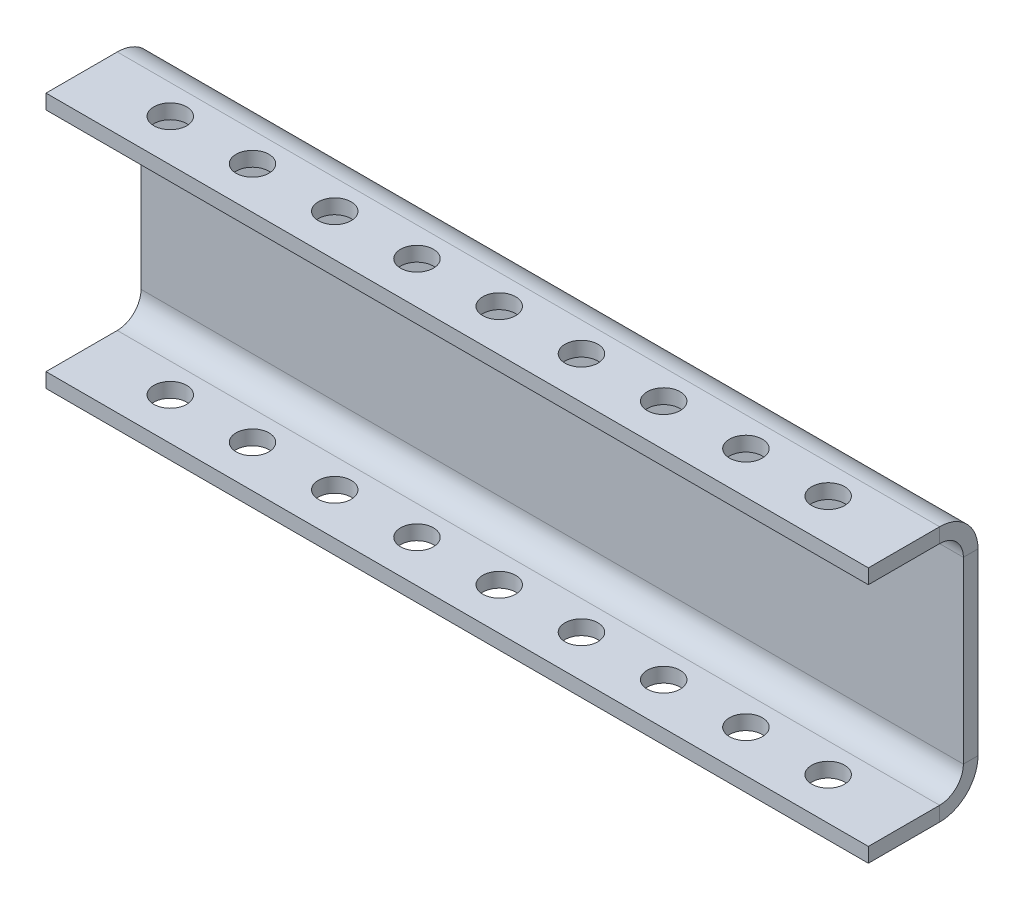
ISO-10303-21;
HEADER;
FILE_DESCRIPTION(('STEP AP214'),'2;1');
FILE_NAME('part.step','',(''),(''),'','','');
FILE_SCHEMA(('AUTOMOTIVE_DESIGN { 1 0 10303 214 1 1 1 1 }'));
ENDSEC;
DATA;
#1=APPLICATION_CONTEXT('core data for automotive mechanical design processes');
#2=APPLICATION_PROTOCOL_DEFINITION('international standard','automotive_design',2000,#1);
#3=PRODUCT_CONTEXT('',#1,'mechanical');
#4=PRODUCT('Part','Part','',(#3));
#5=PRODUCT_RELATED_PRODUCT_CATEGORY('part','',(#4));
#6=PRODUCT_DEFINITION_FORMATION('','',#4);
#7=PRODUCT_DEFINITION_CONTEXT('part definition',#1,'design');
#8=PRODUCT_DEFINITION('design','',#6,#7);
#9=PRODUCT_DEFINITION_SHAPE('','',#8);
#10=(LENGTH_UNIT() NAMED_UNIT(*) SI_UNIT(.MILLI.,.METRE.));
#11=(NAMED_UNIT(*) PLANE_ANGLE_UNIT() SI_UNIT($,.RADIAN.));
#12=(NAMED_UNIT(*) SI_UNIT($,.STERADIAN.) SOLID_ANGLE_UNIT());
#13=UNCERTAINTY_MEASURE_WITH_UNIT(LENGTH_MEASURE(1.E-05),#10,'distance_accuracy_value','');
#14=(GEOMETRIC_REPRESENTATION_CONTEXT(3) GLOBAL_UNCERTAINTY_ASSIGNED_CONTEXT((#13)) GLOBAL_UNIT_ASSIGNED_CONTEXT((#10,
#11,#12)) REPRESENTATION_CONTEXT('',''));
#15=CARTESIAN_POINT('',(0.,0.,0.));
#16=DIRECTION('',(0.,0.,1.));
#17=DIRECTION('',(1.,0.,0.));
#18=AXIS2_PLACEMENT_3D('',#15,#16,#17);
#19=CARTESIAN_POINT('',(0.,229.4,0.));
#20=DIRECTION('',(0.,0.,-1.));
#21=DIRECTION('',(-1.,0.,0.));
#22=AXIS2_PLACEMENT_3D('',#19,#20,#21);
#23=PLANE('',#22);
#24=DIRECTION('',(0.,1.,0.));
#25=VECTOR('',#24,1.);
#26=CARTESIAN_POINT('',(450.,0.,0.));
#27=LINE('',#26,#25);
#28=CARTESIAN_POINT('',(450.,65.7000000000002,0.));
#29=VERTEX_POINT('',#28);
#30=CARTESIAN_POINT('',(450.,163.7,0.));
#31=VERTEX_POINT('',#30);
#32=EDGE_CURVE('E61',#29,#31,#27,.T.);
#33=ORIENTED_EDGE('',*,*,#32,.T.);
#34=DIRECTION('',(-1.,0.,0.));
#35=VECTOR('',#34,1.);
#36=CARTESIAN_POINT('',(0.,163.7,0.));
#37=LINE('',#36,#35);
#38=CARTESIAN_POINT('',(0.,163.7,0.));
#39=VERTEX_POINT('',#38);
#40=EDGE_CURVE('E53',#31,#39,#37,.T.);
#41=ORIENTED_EDGE('',*,*,#40,.T.);
#42=DIRECTION('',(0.,-1.,0.));
#43=VECTOR('',#42,1.);
#44=CARTESIAN_POINT('',(0.,0.,0.));
#45=LINE('',#44,#43);
#46=CARTESIAN_POINT('',(0.,65.7000000000001,0.));
#47=VERTEX_POINT('',#46);
#48=EDGE_CURVE('E69',#39,#47,#45,.T.);
#49=ORIENTED_EDGE('',*,*,#48,.T.);
#50=DIRECTION('',(-1.,0.,0.));
#51=VECTOR('',#50,1.);
#52=CARTESIAN_POINT('',(0.,65.7000000000002,0.));
#53=LINE('',#52,#51);
#54=EDGE_CURVE('E286',#29,#47,#53,.T.);
#55=ORIENTED_EDGE('',*,*,#54,.F.);
#56=EDGE_LOOP('',(#33,#41,#49,#55));
#57=FACE_BOUND('',#56,.T.);
#58=ADVANCED_FACE('F44',(#57),#23,.F.);
#59=CARTESIAN_POINT('',(0.,229.4,-8.));
#60=DIRECTION('',(0.,0.,-1.));
#61=DIRECTION('',(-1.,0.,0.));
#62=AXIS2_PLACEMENT_3D('',#59,#60,#61);
#63=PLANE('',#62);
#64=DIRECTION('',(-1.,0.,0.));
#65=VECTOR('',#64,1.);
#66=CARTESIAN_POINT('',(0.,163.7,-8.));
#67=LINE('',#66,#65);
#68=CARTESIAN_POINT('',(450.,163.7,-8.));
#69=VERTEX_POINT('',#68);
#70=CARTESIAN_POINT('',(0.,163.7,-8.));
#71=VERTEX_POINT('',#70);
#72=EDGE_CURVE('E290',#69,#71,#67,.T.);
#73=ORIENTED_EDGE('',*,*,#72,.F.);
#74=DIRECTION('',(0.,1.,0.));
#75=VECTOR('',#74,1.);
#76=CARTESIAN_POINT('',(450.,0.,-8.));
#77=LINE('',#76,#75);
#78=CARTESIAN_POINT('',(450.,65.7000000000002,-7.99999999999999));
#79=VERTEX_POINT('',#78);
#80=EDGE_CURVE('E283',#79,#69,#77,.T.);
#81=ORIENTED_EDGE('',*,*,#80,.F.);
#82=DIRECTION('',(-1.,0.,0.));
#83=VECTOR('',#82,1.);
#84=CARTESIAN_POINT('',(0.,65.7000000000002,-8.));
#85=LINE('',#84,#83);
#86=CARTESIAN_POINT('',(0.,65.7000000000002,-8.));
#87=VERTEX_POINT('',#86);
#88=EDGE_CURVE('E279',#79,#87,#85,.T.);
#89=ORIENTED_EDGE('',*,*,#88,.T.);
#90=DIRECTION('',(0.,-1.,0.));
#91=VECTOR('',#90,1.);
#92=CARTESIAN_POINT('',(0.,0.,-8.));
#93=LINE('',#92,#91);
#94=EDGE_CURVE('E48',#71,#87,#93,.T.);
#95=ORIENTED_EDGE('',*,*,#94,.F.);
#96=EDGE_LOOP('',(#73,#81,#89,#95));
#97=FACE_BOUND('',#96,.T.);
#98=ADVANCED_FACE('F304',(#97),#63,.T.);
#99=CARTESIAN_POINT('',(450.,0.,-8.));
#100=DIRECTION('',(1.,0.,0.));
#101=DIRECTION('',(0.,0.,-1.));
#102=AXIS2_PLACEMENT_3D('',#99,#100,#101);
#103=PLANE('',#102);
#104=DIRECTION('',(0.,0.,-1.));
#105=VECTOR('',#104,1.);
#106=CARTESIAN_POINT('',(450.,163.7,-7.99999999999886));
#107=LINE('',#106,#105);
#108=EDGE_CURVE('E12',#31,#69,#107,.T.);
#109=ORIENTED_EDGE('',*,*,#108,.F.);
#110=ORIENTED_EDGE('',*,*,#32,.F.);
#111=DIRECTION('',(0.,0.,-1.));
#112=VECTOR('',#111,1.);
#113=CARTESIAN_POINT('',(450.,65.7000000000001,-7.99999999999954));
#114=LINE('',#113,#112);
#115=EDGE_CURVE('E282',#29,#79,#114,.T.);
#116=ORIENTED_EDGE('',*,*,#115,.T.);
#117=ORIENTED_EDGE('',*,*,#80,.T.);
#118=EDGE_LOOP('',(#109,#110,#116,#117));
#119=FACE_BOUND('',#118,.T.);
#120=ADVANCED_FACE('F46',(#119),#103,.T.);
#121=CARTESIAN_POINT('',(0.,0.,-8.));
#122=DIRECTION('',(-1.,0.,0.));
#123=DIRECTION('',(0.,0.,1.));
#124=AXIS2_PLACEMENT_3D('',#121,#122,#123);
#125=PLANE('',#124);
#126=DIRECTION('',(0.,0.,1.));
#127=VECTOR('',#126,1.);
#128=CARTESIAN_POINT('',(0.,163.7,-7.99999999999886));
#129=LINE('',#128,#127);
#130=EDGE_CURVE('E293',#71,#39,#129,.T.);
#131=ORIENTED_EDGE('',*,*,#130,.F.);
#132=ORIENTED_EDGE('',*,*,#94,.T.);
#133=DIRECTION('',(0.,0.,1.));
#134=VECTOR('',#133,1.);
#135=CARTESIAN_POINT('',(0.,65.7000000000002,-7.99999999999954));
#136=LINE('',#135,#134);
#137=EDGE_CURVE('E288',#87,#47,#136,.T.);
#138=ORIENTED_EDGE('',*,*,#137,.T.);
#139=ORIENTED_EDGE('',*,*,#48,.F.);
#140=EDGE_LOOP('',(#131,#132,#138,#139));
#141=FACE_BOUND('',#140,.T.);
#142=ADVANCED_FACE('F299',(#141),#125,.T.);
#143=CARTESIAN_POINT('',(450.,65.7000000000001,13.));
#144=DIRECTION('',(1.,0.,0.));
#145=DIRECTION('',(0.,0.,-1.));
#146=AXIS2_PLACEMENT_3D('',#143,#144,#145);
#147=PLANE('',#146);
#148=ORIENTED_EDGE('',*,*,#115,.F.);
#149=CARTESIAN_POINT('',(450.,65.7000000000002,13.));
#150=DIRECTION('',(-1.,0.,0.));
#151=DIRECTION('',(0.,-1.,0.));
#152=AXIS2_PLACEMENT_3D('',#149,#150,#151);
#153=CIRCLE('',#152,13.);
#154=CARTESIAN_POINT('',(450.,52.7000000000001,13.0000000000001));
#155=VERTEX_POINT('',#154);
#156=EDGE_CURVE('E185',#29,#155,#153,.T.);
#157=ORIENTED_EDGE('',*,*,#156,.T.);
#158=DIRECTION('',(0.,-1.,0.));
#159=VECTOR('',#158,1.);
#160=CARTESIAN_POINT('',(450.,44.7000000000004,13.0000000000001));
#161=LINE('',#160,#159);
#162=CARTESIAN_POINT('',(450.,44.7000000000001,13.));
#163=VERTEX_POINT('',#162);
#164=EDGE_CURVE('E260',#155,#163,#161,.T.);
#165=ORIENTED_EDGE('',*,*,#164,.T.);
#166=CARTESIAN_POINT('',(450.,65.7000000000001,13.));
#167=DIRECTION('',(-1.,0.,0.));
#168=DIRECTION('',(0.,0.,-1.));
#169=AXIS2_PLACEMENT_3D('',#166,#167,#168);
#170=CIRCLE('',#169,21.);
#171=EDGE_CURVE('E268',#79,#163,#170,.T.);
#172=ORIENTED_EDGE('',*,*,#171,.F.);
#173=EDGE_LOOP('',(#148,#157,#165,#172));
#174=FACE_BOUND('',#173,.T.);
#175=ADVANCED_FACE('F439',(#174),#147,.T.);
#176=CARTESIAN_POINT('',(0.,65.7000000000002,13.));
#177=DIRECTION('',(-1.,0.,0.));
#178=DIRECTION('',(0.,-1.,0.));
#179=AXIS2_PLACEMENT_3D('',#176,#177,#178);
#180=PLANE('',#179);
#181=DIRECTION('',(0.,1.,0.));
#182=VECTOR('',#181,1.);
#183=CARTESIAN_POINT('',(0.,44.7000000000005,13.0000000000001));
#184=LINE('',#183,#182);
#185=CARTESIAN_POINT('',(0.,44.7000000000002,13.0000000000001));
#186=VERTEX_POINT('',#185);
#187=CARTESIAN_POINT('',(0.,52.7000000000002,13.0000000000001));
#188=VERTEX_POINT('',#187);
#189=EDGE_CURVE('E263',#186,#188,#184,.T.);
#190=ORIENTED_EDGE('',*,*,#189,.T.);
#191=CARTESIAN_POINT('',(0.,65.7000000000002,13.));
#192=DIRECTION('',(-1.,0.,0.));
#193=DIRECTION('',(0.,-1.,0.));
#194=AXIS2_PLACEMENT_3D('',#191,#192,#193);
#195=CIRCLE('',#194,13.);
#196=EDGE_CURVE('E272',#188,#47,#195,.F.);
#197=ORIENTED_EDGE('',*,*,#196,.T.);
#198=ORIENTED_EDGE('',*,*,#137,.F.);
#199=CARTESIAN_POINT('',(0.,65.7000000000002,13.));
#200=DIRECTION('',(1.,0.,0.));
#201=DIRECTION('',(0.,-1.,0.));
#202=AXIS2_PLACEMENT_3D('',#199,#200,#201);
#203=CIRCLE('',#202,21.);
#204=EDGE_CURVE('E271',#186,#87,#203,.T.);
#205=ORIENTED_EDGE('',*,*,#204,.F.);
#206=EDGE_LOOP('',(#190,#197,#198,#205));
#207=FACE_BOUND('',#206,.T.);
#208=ADVANCED_FACE('F309',(#207),#180,.T.);
#209=CARTESIAN_POINT('',(675.862594276769,65.7000000000001,13.));
#210=DIRECTION('',(-1.,0.,0.));
#211=DIRECTION('',(0.,-1.,0.));
#212=AXIS2_PLACEMENT_3D('',#209,#210,#211);
#213=CYLINDRICAL_SURFACE('',#212,21.);
#214=ORIENTED_EDGE('',*,*,#204,.T.);
#215=ORIENTED_EDGE('',*,*,#88,.F.);
#216=ORIENTED_EDGE('',*,*,#171,.T.);
#217=DIRECTION('',(-1.,0.,0.));
#218=VECTOR('',#217,1.);
#219=CARTESIAN_POINT('',(0.,44.7000000000002,13.));
#220=LINE('',#219,#218);
#221=EDGE_CURVE('E177',#163,#186,#220,.T.);
#222=ORIENTED_EDGE('',*,*,#221,.T.);
#223=EDGE_LOOP('',(#214,#215,#216,#222));
#224=FACE_BOUND('',#223,.T.);
#225=ADVANCED_FACE('F306',(#224),#213,.T.);
#226=CARTESIAN_POINT('',(675.862594276769,65.7000000000001,13.));
#227=DIRECTION('',(-1.,0.,0.));
#228=DIRECTION('',(0.,-1.,0.));
#229=AXIS2_PLACEMENT_3D('',#226,#227,#228);
#230=CYLINDRICAL_SURFACE('',#229,13.);
#231=ORIENTED_EDGE('',*,*,#196,.F.);
#232=DIRECTION('',(-1.,0.,0.));
#233=VECTOR('',#232,1.);
#234=CARTESIAN_POINT('',(0.,52.7000000000002,13.0000000000001));
#235=LINE('',#234,#233);
#236=EDGE_CURVE('E193',#155,#188,#235,.T.);
#237=ORIENTED_EDGE('',*,*,#236,.F.);
#238=ORIENTED_EDGE('',*,*,#156,.F.);
#239=ORIENTED_EDGE('',*,*,#54,.T.);
#240=EDGE_LOOP('',(#231,#237,#238,#239));
#241=FACE_BOUND('',#240,.T.);
#242=ADVANCED_FACE('F446',(#241),#230,.F.);
#243=CARTESIAN_POINT('',(89.9999999999999,44.7000000000003,28.996462444487));
#244=DIRECTION('',(0.,1.,0.));
#245=DIRECTION('',(1.,0.,0.));
#246=AXIS2_PLACEMENT_3D('',#243,#244,#245);
#247=CYLINDRICAL_SURFACE('',#246,9.00000000000001);
#248=CARTESIAN_POINT('',(89.9999999999999,44.7000000000003,28.996462444487));
#249=DIRECTION('',(0.,1.,0.));
#250=DIRECTION('',(-1.,0.,0.));
#251=AXIS2_PLACEMENT_3D('',#248,#249,#250);
#252=CIRCLE('',#251,9.00000000000001);
#253=CARTESIAN_POINT('',(80.9999999999999,44.7000000000003,28.996462444487));
#254=VERTEX_POINT('',#253);
#255=EDGE_CURVE('E201',#254,#254,#252,.T.);
#256=ORIENTED_EDGE('',*,*,#255,.F.);
#257=EDGE_LOOP('',(#256));
#258=FACE_BOUND('',#257,.T.);
#259=CARTESIAN_POINT('',(89.9999999999999,52.7000000000002,28.9964624444869));
#260=DIRECTION('',(0.,1.,0.));
#261=DIRECTION('',(-1.,0.,0.));
#262=AXIS2_PLACEMENT_3D('',#259,#260,#261);
#263=CIRCLE('',#262,9.00000000000001);
#264=CARTESIAN_POINT('',(80.9999999999999,52.7000000000002,28.9964624444869));
#265=VERTEX_POINT('',#264);
#266=EDGE_CURVE('E257',#265,#265,#263,.T.);
#267=ORIENTED_EDGE('',*,*,#266,.T.);
#268=EDGE_LOOP('',(#267));
#269=FACE_BOUND('',#268,.T.);
#270=ADVANCED_FACE('F449',(#258,#269),#247,.F.);
#271=CARTESIAN_POINT('',(135.,44.7000000000002,28.9964624444869));
#272=DIRECTION('',(0.,1.,0.));
#273=DIRECTION('',(1.,0.,0.));
#274=AXIS2_PLACEMENT_3D('',#271,#272,#273);
#275=CYLINDRICAL_SURFACE('',#274,9.00000000000004);
#276=CARTESIAN_POINT('',(135.,44.7000000000002,28.9964624444869));
#277=DIRECTION('',(0.,1.,0.));
#278=DIRECTION('',(-1.,0.,0.));
#279=AXIS2_PLACEMENT_3D('',#276,#277,#278);
#280=CIRCLE('',#279,9.00000000000004);
#281=CARTESIAN_POINT('',(126.,44.7000000000002,28.9964624444869));
#282=VERTEX_POINT('',#281);
#283=EDGE_CURVE('E204',#282,#282,#280,.T.);
#284=ORIENTED_EDGE('',*,*,#283,.F.);
#285=EDGE_LOOP('',(#284));
#286=FACE_BOUND('',#285,.T.);
#287=CARTESIAN_POINT('',(135.,52.7000000000002,28.9964624444869));
#288=DIRECTION('',(0.,1.,0.));
#289=DIRECTION('',(-1.,0.,0.));
#290=AXIS2_PLACEMENT_3D('',#287,#288,#289);
#291=CIRCLE('',#290,9.00000000000004);
#292=CARTESIAN_POINT('',(126.,52.7000000000002,28.9964624444869));
#293=VERTEX_POINT('',#292);
#294=EDGE_CURVE('E254',#293,#293,#291,.T.);
#295=ORIENTED_EDGE('',*,*,#294,.T.);
#296=EDGE_LOOP('',(#295));
#297=FACE_BOUND('',#296,.T.);
#298=ADVANCED_FACE('F499',(#286,#297),#275,.F.);
#299=CARTESIAN_POINT('',(45.,44.7000000000003,28.996462444487));
#300=DIRECTION('',(0.,1.,0.));
#301=DIRECTION('',(1.,0.,0.));
#302=AXIS2_PLACEMENT_3D('',#299,#300,#301);
#303=CYLINDRICAL_SURFACE('',#302,9.00000000000001);
#304=CARTESIAN_POINT('',(45.,44.7000000000003,28.996462444487));
#305=DIRECTION('',(0.,1.,0.));
#306=DIRECTION('',(-1.,0.,0.));
#307=AXIS2_PLACEMENT_3D('',#304,#305,#306);
#308=CIRCLE('',#307,9.00000000000001);
#309=CARTESIAN_POINT('',(36.,44.7000000000003,28.996462444487));
#310=VERTEX_POINT('',#309);
#311=EDGE_CURVE('E207',#310,#310,#308,.T.);
#312=ORIENTED_EDGE('',*,*,#311,.F.);
#313=EDGE_LOOP('',(#312));
#314=FACE_BOUND('',#313,.T.);
#315=CARTESIAN_POINT('',(45.,52.7000000000003,28.9964624444869));
#316=DIRECTION('',(0.,1.,0.));
#317=DIRECTION('',(-1.,0.,0.));
#318=AXIS2_PLACEMENT_3D('',#315,#316,#317);
#319=CIRCLE('',#318,9.00000000000001);
#320=CARTESIAN_POINT('',(36.,52.7000000000003,28.9964624444869));
#321=VERTEX_POINT('',#320);
#322=EDGE_CURVE('E251',#321,#321,#319,.T.);
#323=ORIENTED_EDGE('',*,*,#322,.T.);
#324=EDGE_LOOP('',(#323));
#325=FACE_BOUND('',#324,.T.);
#326=ADVANCED_FACE('F495',(#314,#325),#303,.F.);
#327=CARTESIAN_POINT('',(180.,44.7000000000002,28.9964624444869));
#328=DIRECTION('',(0.,1.,0.));
#329=DIRECTION('',(1.,0.,0.));
#330=AXIS2_PLACEMENT_3D('',#327,#328,#329);
#331=CYLINDRICAL_SURFACE('',#330,9.00000000000001);
#332=CARTESIAN_POINT('',(180.,44.7000000000002,28.9964624444869));
#333=DIRECTION('',(0.,1.,0.));
#334=DIRECTION('',(-1.,0.,0.));
#335=AXIS2_PLACEMENT_3D('',#332,#333,#334);
#336=CIRCLE('',#335,9.00000000000001);
#337=CARTESIAN_POINT('',(171.,44.7000000000002,28.9964624444869));
#338=VERTEX_POINT('',#337);
#339=EDGE_CURVE('E210',#338,#338,#336,.T.);
#340=ORIENTED_EDGE('',*,*,#339,.F.);
#341=EDGE_LOOP('',(#340));
#342=FACE_BOUND('',#341,.T.);
#343=CARTESIAN_POINT('',(180.,52.7000000000002,28.9964624444869));
#344=DIRECTION('',(0.,1.,0.));
#345=DIRECTION('',(-1.,0.,0.));
#346=AXIS2_PLACEMENT_3D('',#343,#344,#345);
#347=CIRCLE('',#346,9.00000000000001);
#348=CARTESIAN_POINT('',(171.,52.7000000000002,28.9964624444869));
#349=VERTEX_POINT('',#348);
#350=EDGE_CURVE('E248',#349,#349,#347,.T.);
#351=ORIENTED_EDGE('',*,*,#350,.T.);
#352=EDGE_LOOP('',(#351));
#353=FACE_BOUND('',#352,.T.);
#354=ADVANCED_FACE('F491',(#342,#353),#331,.F.);
#355=CARTESIAN_POINT('',(225.,44.7000000000002,28.9964624444869));
#356=DIRECTION('',(0.,1.,0.));
#357=DIRECTION('',(1.,0.,0.));
#358=AXIS2_PLACEMENT_3D('',#355,#356,#357);
#359=CYLINDRICAL_SURFACE('',#358,9.00000000000001);
#360=CARTESIAN_POINT('',(225.,44.7000000000002,28.9964624444869));
#361=DIRECTION('',(0.,1.,0.));
#362=DIRECTION('',(-1.,0.,0.));
#363=AXIS2_PLACEMENT_3D('',#360,#361,#362);
#364=CIRCLE('',#363,9.00000000000001);
#365=CARTESIAN_POINT('',(216.,44.7000000000002,28.9964624444869));
#366=VERTEX_POINT('',#365);
#367=EDGE_CURVE('E213',#366,#366,#364,.T.);
#368=ORIENTED_EDGE('',*,*,#367,.F.);
#369=EDGE_LOOP('',(#368));
#370=FACE_BOUND('',#369,.T.);
#371=CARTESIAN_POINT('',(225.,52.7000000000002,28.9964624444869));
#372=DIRECTION('',(0.,1.,0.));
#373=DIRECTION('',(-1.,0.,0.));
#374=AXIS2_PLACEMENT_3D('',#371,#372,#373);
#375=CIRCLE('',#374,9.00000000000001);
#376=CARTESIAN_POINT('',(216.,52.7000000000002,28.9964624444869));
#377=VERTEX_POINT('',#376);
#378=EDGE_CURVE('E245',#377,#377,#375,.T.);
#379=ORIENTED_EDGE('',*,*,#378,.T.);
#380=EDGE_LOOP('',(#379));
#381=FACE_BOUND('',#380,.T.);
#382=ADVANCED_FACE('F487',(#370,#381),#359,.F.);
#383=CARTESIAN_POINT('',(270.,44.7000000000002,28.9964624444869));
#384=DIRECTION('',(0.,1.,0.));
#385=DIRECTION('',(1.,0.,0.));
#386=AXIS2_PLACEMENT_3D('',#383,#384,#385);
#387=CYLINDRICAL_SURFACE('',#386,8.99999999999998);
#388=CARTESIAN_POINT('',(270.,44.7000000000002,28.9964624444869));
#389=DIRECTION('',(0.,1.,0.));
#390=DIRECTION('',(-1.,0.,0.));
#391=AXIS2_PLACEMENT_3D('',#388,#389,#390);
#392=CIRCLE('',#391,8.99999999999998);
#393=CARTESIAN_POINT('',(261.,44.7000000000002,28.9964624444869));
#394=VERTEX_POINT('',#393);
#395=EDGE_CURVE('E216',#394,#394,#392,.T.);
#396=ORIENTED_EDGE('',*,*,#395,.F.);
#397=EDGE_LOOP('',(#396));
#398=FACE_BOUND('',#397,.T.);
#399=CARTESIAN_POINT('',(270.,52.7000000000002,28.9964624444869));
#400=DIRECTION('',(0.,1.,0.));
#401=DIRECTION('',(-1.,0.,0.));
#402=AXIS2_PLACEMENT_3D('',#399,#400,#401);
#403=CIRCLE('',#402,8.99999999999998);
#404=CARTESIAN_POINT('',(261.,52.7000000000002,28.9964624444869));
#405=VERTEX_POINT('',#404);
#406=EDGE_CURVE('E242',#405,#405,#403,.T.);
#407=ORIENTED_EDGE('',*,*,#406,.T.);
#408=EDGE_LOOP('',(#407));
#409=FACE_BOUND('',#408,.T.);
#410=ADVANCED_FACE('F483',(#398,#409),#387,.F.);
#411=CARTESIAN_POINT('',(315.,44.7000000000002,28.9964624444869));
#412=DIRECTION('',(0.,1.,0.));
#413=DIRECTION('',(1.,0.,0.));
#414=AXIS2_PLACEMENT_3D('',#411,#412,#413);
#415=CYLINDRICAL_SURFACE('',#414,9.00000000000004);
#416=CARTESIAN_POINT('',(315.,44.7000000000002,28.9964624444869));
#417=DIRECTION('',(0.,1.,0.));
#418=DIRECTION('',(-1.,0.,0.));
#419=AXIS2_PLACEMENT_3D('',#416,#417,#418);
#420=CIRCLE('',#419,9.00000000000004);
#421=CARTESIAN_POINT('',(306.,44.7000000000002,28.9964624444869));
#422=VERTEX_POINT('',#421);
#423=EDGE_CURVE('E219',#422,#422,#420,.T.);
#424=ORIENTED_EDGE('',*,*,#423,.F.);
#425=EDGE_LOOP('',(#424));
#426=FACE_BOUND('',#425,.T.);
#427=CARTESIAN_POINT('',(315.,52.7000000000002,28.9964624444869));
#428=DIRECTION('',(0.,1.,0.));
#429=DIRECTION('',(-1.,0.,0.));
#430=AXIS2_PLACEMENT_3D('',#427,#428,#429);
#431=CIRCLE('',#430,9.00000000000004);
#432=CARTESIAN_POINT('',(306.,52.7000000000002,28.9964624444869));
#433=VERTEX_POINT('',#432);
#434=EDGE_CURVE('E239',#433,#433,#431,.T.);
#435=ORIENTED_EDGE('',*,*,#434,.T.);
#436=EDGE_LOOP('',(#435));
#437=FACE_BOUND('',#436,.T.);
#438=ADVANCED_FACE('F479',(#426,#437),#415,.F.);
#439=CARTESIAN_POINT('',(360.,44.7000000000002,28.9964624444869));
#440=DIRECTION('',(0.,1.,0.));
#441=DIRECTION('',(1.,0.,0.));
#442=AXIS2_PLACEMENT_3D('',#439,#440,#441);
#443=CYLINDRICAL_SURFACE('',#442,9.00000000000004);
#444=CARTESIAN_POINT('',(360.,44.7000000000002,28.9964624444869));
#445=DIRECTION('',(0.,1.,0.));
#446=DIRECTION('',(-1.,0.,0.));
#447=AXIS2_PLACEMENT_3D('',#444,#445,#446);
#448=CIRCLE('',#447,9.00000000000004);
#449=CARTESIAN_POINT('',(350.999999999999,44.7000000000002,28.9964624444869));
#450=VERTEX_POINT('',#449);
#451=EDGE_CURVE('E222',#450,#450,#448,.T.);
#452=ORIENTED_EDGE('',*,*,#451,.F.);
#453=EDGE_LOOP('',(#452));
#454=FACE_BOUND('',#453,.T.);
#455=CARTESIAN_POINT('',(360.,52.7000000000002,28.9964624444869));
#456=DIRECTION('',(0.,1.,0.));
#457=DIRECTION('',(-1.,0.,0.));
#458=AXIS2_PLACEMENT_3D('',#455,#456,#457);
#459=CIRCLE('',#458,9.00000000000004);
#460=CARTESIAN_POINT('',(350.999999999999,52.7000000000002,28.9964624444869));
#461=VERTEX_POINT('',#460);
#462=EDGE_CURVE('E236',#461,#461,#459,.T.);
#463=ORIENTED_EDGE('',*,*,#462,.T.);
#464=EDGE_LOOP('',(#463));
#465=FACE_BOUND('',#464,.T.);
#466=ADVANCED_FACE('F475',(#454,#465),#443,.F.);
#467=CARTESIAN_POINT('',(404.999999999999,44.7000000000002,28.9964624444869));
#468=DIRECTION('',(0.,1.,0.));
#469=DIRECTION('',(1.,0.,0.));
#470=AXIS2_PLACEMENT_3D('',#467,#468,#469);
#471=CYLINDRICAL_SURFACE('',#470,9.00000000000004);
#472=CARTESIAN_POINT('',(404.999999999999,44.7000000000002,28.9964624444869));
#473=DIRECTION('',(0.,1.,0.));
#474=DIRECTION('',(-1.,0.,0.));
#475=AXIS2_PLACEMENT_3D('',#472,#473,#474);
#476=CIRCLE('',#475,9.00000000000004);
#477=CARTESIAN_POINT('',(395.999999999999,44.7000000000002,28.9964624444869));
#478=VERTEX_POINT('',#477);
#479=EDGE_CURVE('E225',#478,#478,#476,.T.);
#480=ORIENTED_EDGE('',*,*,#479,.F.);
#481=EDGE_LOOP('',(#480));
#482=FACE_BOUND('',#481,.T.);
#483=CARTESIAN_POINT('',(404.999999999999,52.7000000000002,28.9964624444869));
#484=DIRECTION('',(0.,1.,0.));
#485=DIRECTION('',(-1.,0.,0.));
#486=AXIS2_PLACEMENT_3D('',#483,#484,#485);
#487=CIRCLE('',#486,9.00000000000004);
#488=CARTESIAN_POINT('',(395.999999999999,52.7000000000002,28.9964624444869));
#489=VERTEX_POINT('',#488);
#490=EDGE_CURVE('E233',#489,#489,#487,.T.);
#491=ORIENTED_EDGE('',*,*,#490,.T.);
#492=EDGE_LOOP('',(#491));
#493=FACE_BOUND('',#492,.T.);
#494=ADVANCED_FACE('F471',(#482,#493),#471,.F.);
#495=CARTESIAN_POINT('',(0.,44.7000000000003,51.996462444487));
#496=DIRECTION('',(0.,0.,1.));
#497=DIRECTION('',(0.,-1.,0.));
#498=AXIS2_PLACEMENT_3D('',#495,#496,#497);
#499=PLANE('',#498);
#500=DIRECTION('',(1.,0.,0.));
#501=VECTOR('',#500,1.);
#502=CARTESIAN_POINT('',(0.,52.7000000000003,51.9964624444869));
#503=LINE('',#502,#501);
#504=CARTESIAN_POINT('',(0.,52.7000000000003,51.9964624444869));
#505=VERTEX_POINT('',#504);
#506=CARTESIAN_POINT('',(450.,52.7000000000003,51.9964624444869));
#507=VERTEX_POINT('',#506);
#508=EDGE_CURVE('E188',#505,#507,#503,.T.);
#509=ORIENTED_EDGE('',*,*,#508,.F.);
#510=DIRECTION('',(0.,1.,0.));
#511=VECTOR('',#510,1.);
#512=CARTESIAN_POINT('',(0.,44.7000000000003,51.996462444487));
#513=LINE('',#512,#511);
#514=CARTESIAN_POINT('',(0.,44.7000000000003,51.996462444487));
#515=VERTEX_POINT('',#514);
#516=EDGE_CURVE('E182',#515,#505,#513,.T.);
#517=ORIENTED_EDGE('',*,*,#516,.F.);
#518=DIRECTION('',(1.,0.,0.));
#519=VECTOR('',#518,1.);
#520=CARTESIAN_POINT('',(0.,44.7000000000003,51.996462444487));
#521=LINE('',#520,#519);
#522=CARTESIAN_POINT('',(450.,44.7000000000003,51.9964624444869));
#523=VERTEX_POINT('',#522);
#524=EDGE_CURVE('E230',#515,#523,#521,.T.);
#525=ORIENTED_EDGE('',*,*,#524,.T.);
#526=DIRECTION('',(0.,1.,0.));
#527=VECTOR('',#526,1.);
#528=CARTESIAN_POINT('',(450.,44.7000000000003,51.9964624444869));
#529=LINE('',#528,#527);
#530=EDGE_CURVE('E228',#523,#507,#529,.T.);
#531=ORIENTED_EDGE('',*,*,#530,.T.);
#532=EDGE_LOOP('',(#509,#517,#525,#531));
#533=FACE_BOUND('',#532,.T.);
#534=ADVANCED_FACE('F467',(#533),#499,.T.);
#535=CARTESIAN_POINT('',(0.,44.6999999999995,-177.403537555513));
#536=DIRECTION('',(0.,-1.,0.));
#537=DIRECTION('',(-1.,0.,0.));
#538=AXIS2_PLACEMENT_3D('',#535,#536,#537);
#539=PLANE('',#538);
#540=ORIENTED_EDGE('',*,*,#221,.F.);
#541=DIRECTION('',(0.,0.,-1.));
#542=VECTOR('',#541,1.);
#543=CARTESIAN_POINT('',(450.,44.7000000000003,51.9964624444869));
#544=LINE('',#543,#542);
#545=EDGE_CURVE('E198',#523,#163,#544,.T.);
#546=ORIENTED_EDGE('',*,*,#545,.F.);
#547=ORIENTED_EDGE('',*,*,#524,.F.);
#548=DIRECTION('',(0.,0.,1.));
#549=VECTOR('',#548,1.);
#550=CARTESIAN_POINT('',(0.,44.7000000000003,51.996462444487));
#551=LINE('',#550,#549);
#552=EDGE_CURVE('E186',#186,#515,#551,.T.);
#553=ORIENTED_EDGE('',*,*,#552,.F.);
#554=EDGE_LOOP('',(#540,#546,#547,#553));
#555=FACE_BOUND('',#554,.T.);
#556=ORIENTED_EDGE('',*,*,#479,.T.);
#557=EDGE_LOOP('',(#556));
#558=FACE_BOUND('',#557,.T.);
#559=ORIENTED_EDGE('',*,*,#451,.T.);
#560=EDGE_LOOP('',(#559));
#561=FACE_BOUND('',#560,.T.);
#562=ORIENTED_EDGE('',*,*,#423,.T.);
#563=EDGE_LOOP('',(#562));
#564=FACE_BOUND('',#563,.T.);
#565=ORIENTED_EDGE('',*,*,#395,.T.);
#566=EDGE_LOOP('',(#565));
#567=FACE_BOUND('',#566,.T.);
#568=ORIENTED_EDGE('',*,*,#367,.T.);
#569=EDGE_LOOP('',(#568));
#570=FACE_BOUND('',#569,.T.);
#571=ORIENTED_EDGE('',*,*,#339,.T.);
#572=EDGE_LOOP('',(#571));
#573=FACE_BOUND('',#572,.T.);
#574=ORIENTED_EDGE('',*,*,#311,.T.);
#575=EDGE_LOOP('',(#574));
#576=FACE_BOUND('',#575,.T.);
#577=ORIENTED_EDGE('',*,*,#283,.T.);
#578=EDGE_LOOP('',(#577));
#579=FACE_BOUND('',#578,.T.);
#580=ORIENTED_EDGE('',*,*,#255,.T.);
#581=EDGE_LOOP('',(#580));
#582=FACE_BOUND('',#581,.T.);
#583=ADVANCED_FACE('F463',(#555,#558,#561,#564,#567,#570,#573,#576,#579,#582),#539,.T.);
#584=CARTESIAN_POINT('',(450.,44.7000000000003,51.9964624444869));
#585=DIRECTION('',(1.,0.,0.));
#586=DIRECTION('',(0.,-1.,0.));
#587=AXIS2_PLACEMENT_3D('',#584,#585,#586);
#588=PLANE('',#587);
#589=ORIENTED_EDGE('',*,*,#164,.F.);
#590=DIRECTION('',(0.,0.,-1.));
#591=VECTOR('',#590,1.);
#592=CARTESIAN_POINT('',(450.,52.7000000000003,51.9964624444869));
#593=LINE('',#592,#591);
#594=EDGE_CURVE('E196',#507,#155,#593,.T.);
#595=ORIENTED_EDGE('',*,*,#594,.F.);
#596=ORIENTED_EDGE('',*,*,#530,.F.);
#597=ORIENTED_EDGE('',*,*,#545,.T.);
#598=EDGE_LOOP('',(#589,#595,#596,#597));
#599=FACE_BOUND('',#598,.T.);
#600=ADVANCED_FACE('F459',(#599),#588,.T.);
#601=CARTESIAN_POINT('',(0.,52.6999999999995,-177.403537555513));
#602=DIRECTION('',(0.,-1.,0.));
#603=DIRECTION('',(-1.,0.,0.));
#604=AXIS2_PLACEMENT_3D('',#601,#602,#603);
#605=PLANE('',#604);
#606=ORIENTED_EDGE('',*,*,#490,.F.);
#607=EDGE_LOOP('',(#606));
#608=FACE_BOUND('',#607,.T.);
#609=ORIENTED_EDGE('',*,*,#462,.F.);
#610=EDGE_LOOP('',(#609));
#611=FACE_BOUND('',#610,.T.);
#612=ORIENTED_EDGE('',*,*,#434,.F.);
#613=EDGE_LOOP('',(#612));
#614=FACE_BOUND('',#613,.T.);
#615=ORIENTED_EDGE('',*,*,#406,.F.);
#616=EDGE_LOOP('',(#615));
#617=FACE_BOUND('',#616,.T.);
#618=ORIENTED_EDGE('',*,*,#378,.F.);
#619=EDGE_LOOP('',(#618));
#620=FACE_BOUND('',#619,.T.);
#621=ORIENTED_EDGE('',*,*,#350,.F.);
#622=EDGE_LOOP('',(#621));
#623=FACE_BOUND('',#622,.T.);
#624=ORIENTED_EDGE('',*,*,#322,.F.);
#625=EDGE_LOOP('',(#624));
#626=FACE_BOUND('',#625,.T.);
#627=ORIENTED_EDGE('',*,*,#294,.F.);
#628=EDGE_LOOP('',(#627));
#629=FACE_BOUND('',#628,.T.);
#630=ORIENTED_EDGE('',*,*,#266,.F.);
#631=EDGE_LOOP('',(#630));
#632=FACE_BOUND('',#631,.T.);
#633=ORIENTED_EDGE('',*,*,#594,.T.);
#634=ORIENTED_EDGE('',*,*,#236,.T.);
#635=DIRECTION('',(0.,0.,1.));
#636=VECTOR('',#635,1.);
#637=CARTESIAN_POINT('',(0.,52.7000000000003,51.9964624444869));
#638=LINE('',#637,#636);
#639=EDGE_CURVE('E191',#188,#505,#638,.T.);
#640=ORIENTED_EDGE('',*,*,#639,.T.);
#641=ORIENTED_EDGE('',*,*,#508,.T.);
#642=EDGE_LOOP('',(#633,#634,#640,#641));
#643=FACE_BOUND('',#642,.T.);
#644=ADVANCED_FACE('F455',(#608,#611,#614,#617,#620,#623,#626,#629,#632,#643),#605,.F.);
#645=CARTESIAN_POINT('',(0.,44.7000000000003,51.996462444487));
#646=DIRECTION('',(-1.,0.,0.));
#647=DIRECTION('',(0.,1.,0.));
#648=AXIS2_PLACEMENT_3D('',#645,#646,#647);
#649=PLANE('',#648);
#650=ORIENTED_EDGE('',*,*,#189,.F.);
#651=ORIENTED_EDGE('',*,*,#552,.T.);
#652=ORIENTED_EDGE('',*,*,#516,.T.);
#653=ORIENTED_EDGE('',*,*,#639,.F.);
#654=EDGE_LOOP('',(#650,#651,#652,#653));
#655=FACE_BOUND('',#654,.T.);
#656=ADVANCED_FACE('F452',(#655),#649,.T.);
#657=CARTESIAN_POINT('',(450.,163.7,13.));
#658=DIRECTION('',(1.,0.,0.));
#659=DIRECTION('',(0.,0.,-1.));
#660=AXIS2_PLACEMENT_3D('',#657,#658,#659);
#661=PLANE('',#660);
#662=DIRECTION('',(0.,1.,0.));
#663=VECTOR('',#662,1.);
#664=CARTESIAN_POINT('',(450.,184.699999999999,13.0000000000001));
#665=LINE('',#664,#663);
#666=CARTESIAN_POINT('',(450.,176.7,13.));
#667=VERTEX_POINT('',#666);
#668=CARTESIAN_POINT('',(450.,184.7,13.0000000000001));
#669=VERTEX_POINT('',#668);
#670=EDGE_CURVE('E144',#667,#669,#665,.T.);
#671=ORIENTED_EDGE('',*,*,#670,.F.);
#672=CARTESIAN_POINT('',(450.,163.7,13.));
#673=DIRECTION('',(1.,0.,0.));
#674=DIRECTION('',(0.,1.,0.));
#675=AXIS2_PLACEMENT_3D('',#672,#673,#674);
#676=CIRCLE('',#675,13.);
#677=EDGE_CURVE('E155',#667,#31,#676,.F.);
#678=ORIENTED_EDGE('',*,*,#677,.T.);
#679=ORIENTED_EDGE('',*,*,#108,.T.);
#680=CARTESIAN_POINT('',(450.,163.7,13.));
#681=DIRECTION('',(-1.,0.,0.));
#682=DIRECTION('',(0.,0.,-1.));
#683=AXIS2_PLACEMENT_3D('',#680,#681,#682);
#684=CIRCLE('',#683,21.);
#685=EDGE_CURVE('E170',#669,#69,#684,.T.);
#686=ORIENTED_EDGE('',*,*,#685,.F.);
#687=EDGE_LOOP('',(#671,#678,#679,#686));
#688=FACE_BOUND('',#687,.T.);
#689=ADVANCED_FACE('F332',(#688),#661,.T.);
#690=CARTESIAN_POINT('',(0.,163.7,13.));
#691=DIRECTION('',(-1.,0.,0.));
#692=DIRECTION('',(0.,-1.,0.));
#693=AXIS2_PLACEMENT_3D('',#690,#691,#692);
#694=PLANE('',#693);
#695=CARTESIAN_POINT('',(0.,163.7,13.));
#696=DIRECTION('',(1.,0.,0.));
#697=DIRECTION('',(0.,1.,0.));
#698=AXIS2_PLACEMENT_3D('',#695,#696,#697);
#699=CIRCLE('',#698,13.);
#700=CARTESIAN_POINT('',(0.,176.7,13.));
#701=VERTEX_POINT('',#700);
#702=EDGE_CURVE('E174',#39,#701,#699,.T.);
#703=ORIENTED_EDGE('',*,*,#702,.T.);
#704=DIRECTION('',(0.,-1.,0.));
#705=VECTOR('',#704,1.);
#706=CARTESIAN_POINT('',(0.,184.699999999999,13.0000000000001));
#707=LINE('',#706,#705);
#708=CARTESIAN_POINT('',(0.,184.7,13.0000000000001));
#709=VERTEX_POINT('',#708);
#710=EDGE_CURVE('E338',#709,#701,#707,.T.);
#711=ORIENTED_EDGE('',*,*,#710,.F.);
#712=CARTESIAN_POINT('',(0.,163.7,13.));
#713=DIRECTION('',(1.,0.,0.));
#714=DIRECTION('',(0.,-1.,0.));
#715=AXIS2_PLACEMENT_3D('',#712,#713,#714);
#716=CIRCLE('',#715,21.);
#717=EDGE_CURVE('E173',#71,#709,#716,.T.);
#718=ORIENTED_EDGE('',*,*,#717,.F.);
#719=ORIENTED_EDGE('',*,*,#130,.T.);
#720=EDGE_LOOP('',(#703,#711,#718,#719));
#721=FACE_BOUND('',#720,.T.);
#722=ADVANCED_FACE('F319',(#721),#694,.T.);
#723=CARTESIAN_POINT('',(-225.862594276769,163.7,13.));
#724=DIRECTION('',(1.,0.,0.));
#725=DIRECTION('',(0.,1.,0.));
#726=AXIS2_PLACEMENT_3D('',#723,#724,#725);
#727=CYLINDRICAL_SURFACE('',#726,21.);
#728=ORIENTED_EDGE('',*,*,#72,.T.);
#729=ORIENTED_EDGE('',*,*,#717,.T.);
#730=DIRECTION('',(-1.,0.,0.));
#731=VECTOR('',#730,1.);
#732=CARTESIAN_POINT('',(0.,184.7,13.0000000000001));
#733=LINE('',#732,#731);
#734=EDGE_CURVE('E341',#669,#709,#733,.T.);
#735=ORIENTED_EDGE('',*,*,#734,.F.);
#736=ORIENTED_EDGE('',*,*,#685,.T.);
#737=EDGE_LOOP('',(#728,#729,#735,#736));
#738=FACE_BOUND('',#737,.T.);
#739=ADVANCED_FACE('F509',(#738),#727,.T.);
#740=CARTESIAN_POINT('',(-225.862594276769,163.7,13.));
#741=DIRECTION('',(1.,0.,0.));
#742=DIRECTION('',(0.,1.,0.));
#743=AXIS2_PLACEMENT_3D('',#740,#741,#742);
#744=CYLINDRICAL_SURFACE('',#743,13.);
#745=ORIENTED_EDGE('',*,*,#40,.F.);
#746=ORIENTED_EDGE('',*,*,#677,.F.);
#747=DIRECTION('',(-1.,0.,0.));
#748=VECTOR('',#747,1.);
#749=CARTESIAN_POINT('',(0.,176.7,13.));
#750=LINE('',#749,#748);
#751=EDGE_CURVE('E162',#667,#701,#750,.T.);
#752=ORIENTED_EDGE('',*,*,#751,.T.);
#753=ORIENTED_EDGE('',*,*,#702,.F.);
#754=EDGE_LOOP('',(#745,#746,#752,#753));
#755=FACE_BOUND('',#754,.T.);
#756=ADVANCED_FACE('F321',(#755),#744,.F.);
#757=CARTESIAN_POINT('',(0.,184.7,51.9964624444869));
#758=DIRECTION('',(0.,0.,1.));
#759=DIRECTION('',(-1.,0.,0.));
#760=AXIS2_PLACEMENT_3D('',#757,#758,#759);
#761=PLANE('',#760);
#762=DIRECTION('',(-1.,0.,0.));
#763=VECTOR('',#762,1.);
#764=CARTESIAN_POINT('',(0.,176.7,51.9964624444869));
#765=LINE('',#764,#763);
#766=CARTESIAN_POINT('',(450.,176.7,51.9964624444868));
#767=VERTEX_POINT('',#766);
#768=CARTESIAN_POINT('',(0.,176.7,51.9964624444869));
#769=VERTEX_POINT('',#768);
#770=EDGE_CURVE('E154',#767,#769,#765,.T.);
#771=ORIENTED_EDGE('',*,*,#770,.F.);
#772=DIRECTION('',(0.,-1.,0.));
#773=VECTOR('',#772,1.);
#774=CARTESIAN_POINT('',(450.,184.7,51.9964624444868));
#775=LINE('',#774,#773);
#776=CARTESIAN_POINT('',(450.,184.7,51.9964624444868));
#777=VERTEX_POINT('',#776);
#778=EDGE_CURVE('E141',#777,#767,#775,.T.);
#779=ORIENTED_EDGE('',*,*,#778,.F.);
#780=DIRECTION('',(-1.,0.,0.));
#781=VECTOR('',#780,1.);
#782=CARTESIAN_POINT('',(0.,184.7,51.9964624444869));
#783=LINE('',#782,#781);
#784=CARTESIAN_POINT('',(0.,184.7,51.9964624444869));
#785=VERTEX_POINT('',#784);
#786=EDGE_CURVE('E152',#777,#785,#783,.T.);
#787=ORIENTED_EDGE('',*,*,#786,.T.);
#788=DIRECTION('',(0.,-1.,0.));
#789=VECTOR('',#788,1.);
#790=CARTESIAN_POINT('',(0.,184.7,51.9964624444869));
#791=LINE('',#790,#789);
#792=EDGE_CURVE('E161',#785,#769,#791,.T.);
#793=ORIENTED_EDGE('',*,*,#792,.T.);
#794=EDGE_LOOP('',(#771,#779,#787,#793));
#795=FACE_BOUND('',#794,.T.);
#796=ADVANCED_FACE('F151',(#795),#761,.T.);
#797=CARTESIAN_POINT('',(404.999999999999,184.7,28.9964624444868));
#798=DIRECTION('',(0.,-1.,0.));
#799=DIRECTION('',(1.,0.,0.));
#800=AXIS2_PLACEMENT_3D('',#797,#798,#799);
#801=CYLINDRICAL_SURFACE('',#800,9.00000000000004);
#802=CARTESIAN_POINT('',(404.999999999999,184.7,28.9964624444868));
#803=DIRECTION('',(0.,-1.,0.));
#804=DIRECTION('',(1.,0.,0.));
#805=AXIS2_PLACEMENT_3D('',#802,#803,#804);
#806=CIRCLE('',#805,9.00000000000004);
#807=CARTESIAN_POINT('',(414.,184.7,28.9964624444868));
#808=VERTEX_POINT('',#807);
#809=EDGE_CURVE('E343',#808,#808,#806,.T.);
#810=ORIENTED_EDGE('',*,*,#809,.F.);
#811=EDGE_LOOP('',(#810));
#812=FACE_BOUND('',#811,.T.);
#813=CARTESIAN_POINT('',(404.999999999999,176.7,28.9964624444868));
#814=DIRECTION('',(0.,-1.,0.));
#815=DIRECTION('',(1.,0.,0.));
#816=AXIS2_PLACEMENT_3D('',#813,#814,#815);
#817=CIRCLE('',#816,9.00000000000004);
#818=CARTESIAN_POINT('',(414.,176.7,28.9964624444868));
#819=VERTEX_POINT('',#818);
#820=EDGE_CURVE('E164',#819,#819,#817,.T.);
#821=ORIENTED_EDGE('',*,*,#820,.T.);
#822=EDGE_LOOP('',(#821));
#823=FACE_BOUND('',#822,.T.);
#824=ADVANCED_FACE('F396',(#812,#823),#801,.F.);
#825=CARTESIAN_POINT('',(360.,184.7,28.9964624444868));
#826=DIRECTION('',(0.,-1.,0.));
#827=DIRECTION('',(1.,0.,0.));
#828=AXIS2_PLACEMENT_3D('',#825,#826,#827);
#829=CYLINDRICAL_SURFACE('',#828,9.00000000000004);
#830=CARTESIAN_POINT('',(360.,184.7,28.9964624444868));
#831=DIRECTION('',(0.,-1.,0.));
#832=DIRECTION('',(1.,0.,0.));
#833=AXIS2_PLACEMENT_3D('',#830,#831,#832);
#834=CIRCLE('',#833,9.00000000000004);
#835=CARTESIAN_POINT('',(369.,184.7,28.9964624444868));
#836=VERTEX_POINT('',#835);
#837=EDGE_CURVE('E346',#836,#836,#834,.T.);
#838=ORIENTED_EDGE('',*,*,#837,.F.);
#839=EDGE_LOOP('',(#838));
#840=FACE_BOUND('',#839,.T.);
#841=CARTESIAN_POINT('',(360.,176.7,28.9964624444868));
#842=DIRECTION('',(0.,-1.,0.));
#843=DIRECTION('',(1.,0.,0.));
#844=AXIS2_PLACEMENT_3D('',#841,#842,#843);
#845=CIRCLE('',#844,9.00000000000004);
#846=CARTESIAN_POINT('',(369.,176.7,28.9964624444868));
#847=VERTEX_POINT('',#846);
#848=EDGE_CURVE('E391',#847,#847,#845,.T.);
#849=ORIENTED_EDGE('',*,*,#848,.T.);
#850=EDGE_LOOP('',(#849));
#851=FACE_BOUND('',#850,.T.);
#852=ADVANCED_FACE('F686',(#840,#851),#829,.F.);
#853=CARTESIAN_POINT('',(315.,184.7,28.9964624444868));
#854=DIRECTION('',(0.,-1.,0.));
#855=DIRECTION('',(1.,0.,0.));
#856=AXIS2_PLACEMENT_3D('',#853,#854,#855);
#857=CYLINDRICAL_SURFACE('',#856,9.00000000000004);
#858=CARTESIAN_POINT('',(315.,184.7,28.9964624444868));
#859=DIRECTION('',(0.,-1.,0.));
#860=DIRECTION('',(1.,0.,0.));
#861=AXIS2_PLACEMENT_3D('',#858,#859,#860);
#862=CIRCLE('',#861,9.00000000000004);
#863=CARTESIAN_POINT('',(324.,184.7,28.9964624444868));
#864=VERTEX_POINT('',#863);
#865=EDGE_CURVE('E349',#864,#864,#862,.T.);
#866=ORIENTED_EDGE('',*,*,#865,.F.);
#867=EDGE_LOOP('',(#866));
#868=FACE_BOUND('',#867,.T.);
#869=CARTESIAN_POINT('',(315.,176.7,28.9964624444868));
#870=DIRECTION('',(0.,-1.,0.));
#871=DIRECTION('',(1.,0.,0.));
#872=AXIS2_PLACEMENT_3D('',#869,#870,#871);
#873=CIRCLE('',#872,9.00000000000004);
#874=CARTESIAN_POINT('',(324.,176.7,28.9964624444868));
#875=VERTEX_POINT('',#874);
#876=EDGE_CURVE('E388',#875,#875,#873,.T.);
#877=ORIENTED_EDGE('',*,*,#876,.T.);
#878=EDGE_LOOP('',(#877));
#879=FACE_BOUND('',#878,.T.);
#880=ADVANCED_FACE('F694',(#868,#879),#857,.F.);
#881=CARTESIAN_POINT('',(270.,184.7,28.9964624444868));
#882=DIRECTION('',(0.,-1.,0.));
#883=DIRECTION('',(1.,0.,0.));
#884=AXIS2_PLACEMENT_3D('',#881,#882,#883);
#885=CYLINDRICAL_SURFACE('',#884,8.99999999999999);
#886=CARTESIAN_POINT('',(270.,184.7,28.9964624444868));
#887=DIRECTION('',(0.,-1.,0.));
#888=DIRECTION('',(1.,0.,0.));
#889=AXIS2_PLACEMENT_3D('',#886,#887,#888);
#890=CIRCLE('',#889,8.99999999999999);
#891=CARTESIAN_POINT('',(279.,184.7,28.9964624444868));
#892=VERTEX_POINT('',#891);
#893=EDGE_CURVE('E352',#892,#892,#890,.T.);
#894=ORIENTED_EDGE('',*,*,#893,.F.);
#895=EDGE_LOOP('',(#894));
#896=FACE_BOUND('',#895,.T.);
#897=CARTESIAN_POINT('',(270.,176.7,28.9964624444868));
#898=DIRECTION('',(0.,-1.,0.));
#899=DIRECTION('',(1.,0.,0.));
#900=AXIS2_PLACEMENT_3D('',#897,#898,#899);
#901=CIRCLE('',#900,8.99999999999999);
#902=CARTESIAN_POINT('',(279.,176.7,28.9964624444868));
#903=VERTEX_POINT('',#902);
#904=EDGE_CURVE('E385',#903,#903,#901,.T.);
#905=ORIENTED_EDGE('',*,*,#904,.T.);
#906=EDGE_LOOP('',(#905));
#907=FACE_BOUND('',#906,.T.);
#908=ADVANCED_FACE('F702',(#896,#907),#885,.F.);
#909=CARTESIAN_POINT('',(225.,184.7,28.9964624444868));
#910=DIRECTION('',(0.,-1.,0.));
#911=DIRECTION('',(1.,0.,0.));
#912=AXIS2_PLACEMENT_3D('',#909,#910,#911);
#913=CYLINDRICAL_SURFACE('',#912,9.00000000000001);
#914=CARTESIAN_POINT('',(225.,184.7,28.9964624444868));
#915=DIRECTION('',(0.,-1.,0.));
#916=DIRECTION('',(1.,0.,0.));
#917=AXIS2_PLACEMENT_3D('',#914,#915,#916);
#918=CIRCLE('',#917,9.00000000000001);
#919=CARTESIAN_POINT('',(234.,184.7,28.9964624444868));
#920=VERTEX_POINT('',#919);
#921=EDGE_CURVE('E355',#920,#920,#918,.T.);
#922=ORIENTED_EDGE('',*,*,#921,.F.);
#923=EDGE_LOOP('',(#922));
#924=FACE_BOUND('',#923,.T.);
#925=CARTESIAN_POINT('',(225.,176.7,28.9964624444868));
#926=DIRECTION('',(0.,-1.,0.));
#927=DIRECTION('',(1.,0.,0.));
#928=AXIS2_PLACEMENT_3D('',#925,#926,#927);
#929=CIRCLE('',#928,9.00000000000001);
#930=CARTESIAN_POINT('',(234.,176.7,28.9964624444868));
#931=VERTEX_POINT('',#930);
#932=EDGE_CURVE('E382',#931,#931,#929,.T.);
#933=ORIENTED_EDGE('',*,*,#932,.T.);
#934=EDGE_LOOP('',(#933));
#935=FACE_BOUND('',#934,.T.);
#936=ADVANCED_FACE('F710',(#924,#935),#913,.F.);
#937=CARTESIAN_POINT('',(180.,184.7,28.9964624444868));
#938=DIRECTION('',(0.,-1.,0.));
#939=DIRECTION('',(1.,0.,0.));
#940=AXIS2_PLACEMENT_3D('',#937,#938,#939);
#941=CYLINDRICAL_SURFACE('',#940,9.00000000000001);
#942=CARTESIAN_POINT('',(180.,184.7,28.9964624444868));
#943=DIRECTION('',(0.,-1.,0.));
#944=DIRECTION('',(1.,0.,0.));
#945=AXIS2_PLACEMENT_3D('',#942,#943,#944);
#946=CIRCLE('',#945,9.00000000000001);
#947=CARTESIAN_POINT('',(189.,184.7,28.9964624444868));
#948=VERTEX_POINT('',#947);
#949=EDGE_CURVE('E358',#948,#948,#946,.T.);
#950=ORIENTED_EDGE('',*,*,#949,.F.);
#951=EDGE_LOOP('',(#950));
#952=FACE_BOUND('',#951,.T.);
#953=CARTESIAN_POINT('',(180.,176.7,28.9964624444868));
#954=DIRECTION('',(0.,-1.,0.));
#955=DIRECTION('',(1.,0.,0.));
#956=AXIS2_PLACEMENT_3D('',#953,#954,#955);
#957=CIRCLE('',#956,9.00000000000001);
#958=CARTESIAN_POINT('',(189.,176.7,28.9964624444868));
#959=VERTEX_POINT('',#958);
#960=EDGE_CURVE('E379',#959,#959,#957,.T.);
#961=ORIENTED_EDGE('',*,*,#960,.T.);
#962=EDGE_LOOP('',(#961));
#963=FACE_BOUND('',#962,.T.);
#964=ADVANCED_FACE('F718',(#952,#963),#941,.F.);
#965=CARTESIAN_POINT('',(45.,184.7,28.9964624444869));
#966=DIRECTION('',(0.,-1.,0.));
#967=DIRECTION('',(1.,0.,0.));
#968=AXIS2_PLACEMENT_3D('',#965,#966,#967);
#969=CYLINDRICAL_SURFACE('',#968,9.00000000000001);
#970=CARTESIAN_POINT('',(45.,184.7,28.9964624444869));
#971=DIRECTION('',(0.,-1.,0.));
#972=DIRECTION('',(1.,0.,0.));
#973=AXIS2_PLACEMENT_3D('',#970,#971,#972);
#974=CIRCLE('',#973,9.00000000000001);
#975=CARTESIAN_POINT('',(54.,184.7,28.9964624444869));
#976=VERTEX_POINT('',#975);
#977=EDGE_CURVE('E361',#976,#976,#974,.T.);
#978=ORIENTED_EDGE('',*,*,#977,.F.);
#979=EDGE_LOOP('',(#978));
#980=FACE_BOUND('',#979,.T.);
#981=CARTESIAN_POINT('',(45.,176.7,28.9964624444868));
#982=DIRECTION('',(0.,-1.,0.));
#983=DIRECTION('',(1.,0.,0.));
#984=AXIS2_PLACEMENT_3D('',#981,#982,#983);
#985=CIRCLE('',#984,9.00000000000001);
#986=CARTESIAN_POINT('',(54.,176.7,28.9964624444868));
#987=VERTEX_POINT('',#986);
#988=EDGE_CURVE('E376',#987,#987,#985,.T.);
#989=ORIENTED_EDGE('',*,*,#988,.T.);
#990=EDGE_LOOP('',(#989));
#991=FACE_BOUND('',#990,.T.);
#992=ADVANCED_FACE('F428',(#980,#991),#969,.F.);
#993=CARTESIAN_POINT('',(135.,184.7,28.9964624444868));
#994=DIRECTION('',(0.,-1.,0.));
#995=DIRECTION('',(1.,0.,0.));
#996=AXIS2_PLACEMENT_3D('',#993,#994,#995);
#997=CYLINDRICAL_SURFACE('',#996,9.00000000000004);
#998=CARTESIAN_POINT('',(135.,184.7,28.9964624444868));
#999=DIRECTION('',(0.,-1.,0.));
#1000=DIRECTION('',(1.,0.,0.));
#1001=AXIS2_PLACEMENT_3D('',#998,#999,#1000);
#1002=CIRCLE('',#1001,9.00000000000004);
#1003=CARTESIAN_POINT('',(144.,184.7,28.9964624444868));
#1004=VERTEX_POINT('',#1003);
#1005=EDGE_CURVE('E364',#1004,#1004,#1002,.T.);
#1006=ORIENTED_EDGE('',*,*,#1005,.F.);
#1007=EDGE_LOOP('',(#1006));
#1008=FACE_BOUND('',#1007,.T.);
#1009=CARTESIAN_POINT('',(135.,176.7,28.9964624444868));
#1010=DIRECTION('',(0.,-1.,0.));
#1011=DIRECTION('',(1.,0.,0.));
#1012=AXIS2_PLACEMENT_3D('',#1009,#1010,#1011);
#1013=CIRCLE('',#1012,9.00000000000004);
#1014=CARTESIAN_POINT('',(144.,176.7,28.9964624444868));
#1015=VERTEX_POINT('',#1014);
#1016=EDGE_CURVE('E373',#1015,#1015,#1013,.T.);
#1017=ORIENTED_EDGE('',*,*,#1016,.T.);
#1018=EDGE_LOOP('',(#1017));
#1019=FACE_BOUND('',#1018,.T.);
#1020=ADVANCED_FACE('F419',(#1008,#1019),#997,.F.);
#1021=CARTESIAN_POINT('',(89.9999999999999,184.7,28.9964624444869));
#1022=DIRECTION('',(0.,-1.,0.));
#1023=DIRECTION('',(1.,0.,0.));
#1024=AXIS2_PLACEMENT_3D('',#1021,#1022,#1023);
#1025=CYLINDRICAL_SURFACE('',#1024,9.00000000000001);
#1026=CARTESIAN_POINT('',(89.9999999999999,184.7,28.9964624444869));
#1027=DIRECTION('',(0.,-1.,0.));
#1028=DIRECTION('',(1.,0.,0.));
#1029=AXIS2_PLACEMENT_3D('',#1026,#1027,#1028);
#1030=CIRCLE('',#1029,9.00000000000001);
#1031=CARTESIAN_POINT('',(98.9999999999999,184.7,28.9964624444869));
#1032=VERTEX_POINT('',#1031);
#1033=EDGE_CURVE('E367',#1032,#1032,#1030,.T.);
#1034=ORIENTED_EDGE('',*,*,#1033,.F.);
#1035=EDGE_LOOP('',(#1034));
#1036=FACE_BOUND('',#1035,.T.);
#1037=CARTESIAN_POINT('',(89.9999999999999,176.7,28.9964624444868));
#1038=DIRECTION('',(0.,-1.,0.));
#1039=DIRECTION('',(1.,0.,0.));
#1040=AXIS2_PLACEMENT_3D('',#1037,#1038,#1039);
#1041=CIRCLE('',#1040,9.00000000000001);
#1042=CARTESIAN_POINT('',(98.9999999999999,176.7,28.9964624444868));
#1043=VERTEX_POINT('',#1042);
#1044=EDGE_CURVE('E370',#1043,#1043,#1041,.T.);
#1045=ORIENTED_EDGE('',*,*,#1044,.T.);
#1046=EDGE_LOOP('',(#1045));
#1047=FACE_BOUND('',#1046,.T.);
#1048=ADVANCED_FACE('F417',(#1036,#1047),#1025,.F.);
#1049=CARTESIAN_POINT('',(0.,184.7,51.9964624444869));
#1050=DIRECTION('',(0.,1.,0.));
#1051=DIRECTION('',(-1.,0.,0.));
#1052=AXIS2_PLACEMENT_3D('',#1049,#1050,#1051);
#1053=PLANE('',#1052);
#1054=ORIENTED_EDGE('',*,*,#1033,.T.);
#1055=EDGE_LOOP('',(#1054));
#1056=FACE_BOUND('',#1055,.T.);
#1057=ORIENTED_EDGE('',*,*,#1005,.T.);
#1058=EDGE_LOOP('',(#1057));
#1059=FACE_BOUND('',#1058,.T.);
#1060=ORIENTED_EDGE('',*,*,#977,.T.);
#1061=EDGE_LOOP('',(#1060));
#1062=FACE_BOUND('',#1061,.T.);
#1063=ORIENTED_EDGE('',*,*,#949,.T.);
#1064=EDGE_LOOP('',(#1063));
#1065=FACE_BOUND('',#1064,.T.);
#1066=ORIENTED_EDGE('',*,*,#921,.T.);
#1067=EDGE_LOOP('',(#1066));
#1068=FACE_BOUND('',#1067,.T.);
#1069=ORIENTED_EDGE('',*,*,#893,.T.);
#1070=EDGE_LOOP('',(#1069));
#1071=FACE_BOUND('',#1070,.T.);
#1072=ORIENTED_EDGE('',*,*,#865,.T.);
#1073=EDGE_LOOP('',(#1072));
#1074=FACE_BOUND('',#1073,.T.);
#1075=ORIENTED_EDGE('',*,*,#837,.T.);
#1076=EDGE_LOOP('',(#1075));
#1077=FACE_BOUND('',#1076,.T.);
#1078=ORIENTED_EDGE('',*,*,#809,.T.);
#1079=EDGE_LOOP('',(#1078));
#1080=FACE_BOUND('',#1079,.T.);
#1081=DIRECTION('',(0.,0.,1.));
#1082=VECTOR('',#1081,1.);
#1083=CARTESIAN_POINT('',(450.,184.700000000001,-177.403537555513));
#1084=LINE('',#1083,#1082);
#1085=EDGE_CURVE('E138',#669,#777,#1084,.T.);
#1086=ORIENTED_EDGE('',*,*,#1085,.F.);
#1087=ORIENTED_EDGE('',*,*,#734,.T.);
#1088=DIRECTION('',(0.,0.,-1.));
#1089=VECTOR('',#1088,1.);
#1090=CARTESIAN_POINT('',(0.,184.700000000001,-177.403537555513));
#1091=LINE('',#1090,#1089);
#1092=EDGE_CURVE('E160',#785,#709,#1091,.T.);
#1093=ORIENTED_EDGE('',*,*,#1092,.F.);
#1094=ORIENTED_EDGE('',*,*,#786,.F.);
#1095=EDGE_LOOP('',(#1086,#1087,#1093,#1094));
#1096=FACE_BOUND('',#1095,.T.);
#1097=ADVANCED_FACE('F158',(#1056,#1059,#1062,#1065,#1068,#1071,#1074,#1077,#1080,#1096),#1053,.T.);
#1098=CARTESIAN_POINT('',(0.,184.700000000001,-177.403537555513));
#1099=DIRECTION('',(-1.,0.,0.));
#1100=DIRECTION('',(0.,-1.,0.));
#1101=AXIS2_PLACEMENT_3D('',#1098,#1099,#1100);
#1102=PLANE('',#1101);
#1103=ORIENTED_EDGE('',*,*,#1092,.T.);
#1104=ORIENTED_EDGE('',*,*,#710,.T.);
#1105=DIRECTION('',(0.,0.,-1.));
#1106=VECTOR('',#1105,1.);
#1107=CARTESIAN_POINT('',(0.,176.700000000001,-177.403537555513));
#1108=LINE('',#1107,#1106);
#1109=EDGE_CURVE('E328',#769,#701,#1108,.T.);
#1110=ORIENTED_EDGE('',*,*,#1109,.F.);
#1111=ORIENTED_EDGE('',*,*,#792,.F.);
#1112=EDGE_LOOP('',(#1103,#1104,#1110,#1111));
#1113=FACE_BOUND('',#1112,.T.);
#1114=ADVANCED_FACE('F399',(#1113),#1102,.T.);
#1115=CARTESIAN_POINT('',(0.,176.7,51.9964624444869));
#1116=DIRECTION('',(0.,1.,0.));
#1117=DIRECTION('',(-1.,0.,0.));
#1118=AXIS2_PLACEMENT_3D('',#1115,#1116,#1117);
#1119=PLANE('',#1118);
#1120=ORIENTED_EDGE('',*,*,#751,.F.);
#1121=DIRECTION('',(0.,0.,1.));
#1122=VECTOR('',#1121,1.);
#1123=CARTESIAN_POINT('',(450.,176.700000000001,-177.403537555513));
#1124=LINE('',#1123,#1122);
#1125=EDGE_CURVE('E326',#667,#767,#1124,.T.);
#1126=ORIENTED_EDGE('',*,*,#1125,.T.);
#1127=ORIENTED_EDGE('',*,*,#770,.T.);
#1128=ORIENTED_EDGE('',*,*,#1109,.T.);
#1129=EDGE_LOOP('',(#1120,#1126,#1127,#1128));
#1130=FACE_BOUND('',#1129,.T.);
#1131=ORIENTED_EDGE('',*,*,#820,.F.);
#1132=EDGE_LOOP('',(#1131));
#1133=FACE_BOUND('',#1132,.T.);
#1134=ORIENTED_EDGE('',*,*,#848,.F.);
#1135=EDGE_LOOP('',(#1134));
#1136=FACE_BOUND('',#1135,.T.);
#1137=ORIENTED_EDGE('',*,*,#876,.F.);
#1138=EDGE_LOOP('',(#1137));
#1139=FACE_BOUND('',#1138,.T.);
#1140=ORIENTED_EDGE('',*,*,#904,.F.);
#1141=EDGE_LOOP('',(#1140));
#1142=FACE_BOUND('',#1141,.T.);
#1143=ORIENTED_EDGE('',*,*,#932,.F.);
#1144=EDGE_LOOP('',(#1143));
#1145=FACE_BOUND('',#1144,.T.);
#1146=ORIENTED_EDGE('',*,*,#960,.F.);
#1147=EDGE_LOOP('',(#1146));
#1148=FACE_BOUND('',#1147,.T.);
#1149=ORIENTED_EDGE('',*,*,#988,.F.);
#1150=EDGE_LOOP('',(#1149));
#1151=FACE_BOUND('',#1150,.T.);
#1152=ORIENTED_EDGE('',*,*,#1016,.F.);
#1153=EDGE_LOOP('',(#1152));
#1154=FACE_BOUND('',#1153,.T.);
#1155=ORIENTED_EDGE('',*,*,#1044,.F.);
#1156=EDGE_LOOP('',(#1155));
#1157=FACE_BOUND('',#1156,.T.);
#1158=ADVANCED_FACE('F324',(#1130,#1133,#1136,#1139,#1142,#1145,#1148,#1151,#1154,#1157),#1119,.F.);
#1159=CARTESIAN_POINT('',(450.,184.700000000001,-177.403537555513));
#1160=DIRECTION('',(1.,0.,0.));
#1161=DIRECTION('',(0.,1.,0.));
#1162=AXIS2_PLACEMENT_3D('',#1159,#1160,#1161);
#1163=PLANE('',#1162);
#1164=ORIENTED_EDGE('',*,*,#1125,.F.);
#1165=ORIENTED_EDGE('',*,*,#670,.T.);
#1166=ORIENTED_EDGE('',*,*,#1085,.T.);
#1167=ORIENTED_EDGE('',*,*,#778,.T.);
#1168=EDGE_LOOP('',(#1164,#1165,#1166,#1167));
#1169=FACE_BOUND('',#1168,.T.);
#1170=ADVANCED_FACE('F140',(#1169),#1163,.T.);
#1171=CLOSED_SHELL('',(#58,#98,#120,#142,#175,#208,#225,#242,#270,#298,#326,#354,#382,#410,#438,
#466,#494,#534,#583,#600,#644,#656,#689,#722,#739,#756,#796,#824,#852,#880,#908,#936,#964,#992,
#1020,#1048,#1097,#1114,#1158,#1170));
#1172=MANIFOLD_SOLID_BREP('B2',#1171);
#1173=ADVANCED_BREP_SHAPE_REPRESENTATION('',(#18,#1172),#14);
#1174=SHAPE_DEFINITION_REPRESENTATION(#9,#1173);
ENDSEC;
END-ISO-10303-21;
